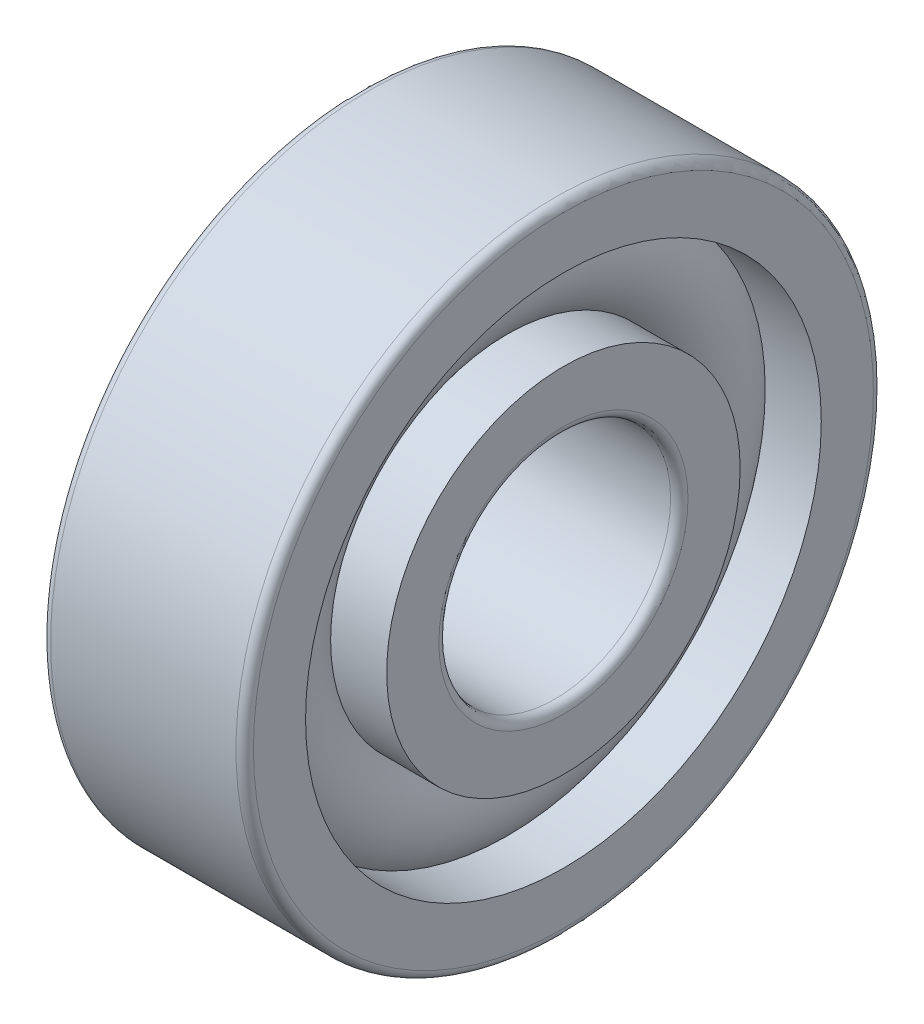
ISO-10303-21;
HEADER;
FILE_DESCRIPTION(('STEP AP214'),'2;1');
FILE_NAME('part.step','',(''),(''),'','','');
FILE_SCHEMA(('AUTOMOTIVE_DESIGN { 1 0 10303 214 1 1 1 1 }'));
ENDSEC;
DATA;
#1=APPLICATION_CONTEXT('core data for automotive mechanical design processes');
#2=APPLICATION_PROTOCOL_DEFINITION('international standard','automotive_design',2000,#1);
#3=PRODUCT_CONTEXT('',#1,'mechanical');
#4=PRODUCT('Part','Part','',(#3));
#5=PRODUCT_RELATED_PRODUCT_CATEGORY('part','',(#4));
#6=PRODUCT_DEFINITION_FORMATION('','',#4);
#7=PRODUCT_DEFINITION_CONTEXT('part definition',#1,'design');
#8=PRODUCT_DEFINITION('design','',#6,#7);
#9=PRODUCT_DEFINITION_SHAPE('','',#8);
#10=(LENGTH_UNIT() NAMED_UNIT(*) SI_UNIT(.MILLI.,.METRE.));
#11=(NAMED_UNIT(*) PLANE_ANGLE_UNIT() SI_UNIT($,.RADIAN.));
#12=(NAMED_UNIT(*) SI_UNIT($,.STERADIAN.) SOLID_ANGLE_UNIT());
#13=UNCERTAINTY_MEASURE_WITH_UNIT(LENGTH_MEASURE(1.E-05),#10,'distance_accuracy_value','');
#14=(GEOMETRIC_REPRESENTATION_CONTEXT(3) GLOBAL_UNCERTAINTY_ASSIGNED_CONTEXT((#13)) GLOBAL_UNIT_ASSIGNED_CONTEXT((#10,
#11,#12)) REPRESENTATION_CONTEXT('',''));
#15=CARTESIAN_POINT('',(0.,0.,0.));
#16=DIRECTION('',(0.,0.,1.));
#17=DIRECTION('',(1.,0.,0.));
#18=AXIS2_PLACEMENT_3D('',#15,#16,#17);
#19=CARTESIAN_POINT('',(0.,0.,0.));
#20=DIRECTION('',(-1.,0.,0.));
#21=DIRECTION('',(0.,0.,1.));
#22=AXIS2_PLACEMENT_3D('',#19,#20,#21);
#23=TOROIDAL_SURFACE('',#22,7.5,2.1);
#24=CARTESIAN_POINT('',(1.56524758424985,0.,0.));
#25=DIRECTION('',(-1.,0.,0.));
#26=DIRECTION('',(0.,0.,1.));
#27=AXIS2_PLACEMENT_3D('',#24,#25,#26);
#28=CIRCLE('',#27,8.9);
#29=CARTESIAN_POINT('',(1.56524758424985,0.,8.9));
#30=VERTEX_POINT('',#29);
#31=EDGE_CURVE('E18',#30,#30,#28,.F.);
#32=ORIENTED_EDGE('',*,*,#31,.T.);
#33=EDGE_LOOP('',(#32));
#34=FACE_BOUND('',#33,.T.);
#35=CARTESIAN_POINT('',(1.56524758424985,0.,0.));
#36=DIRECTION('',(-1.,0.,0.));
#37=DIRECTION('',(0.,0.,1.));
#38=AXIS2_PLACEMENT_3D('',#35,#36,#37);
#39=CIRCLE('',#38,6.1);
#40=CARTESIAN_POINT('',(1.56524758424985,0.,6.1));
#41=VERTEX_POINT('',#40);
#42=EDGE_CURVE('E10',#41,#41,#39,.T.);
#43=ORIENTED_EDGE('',*,*,#42,.T.);
#44=EDGE_LOOP('',(#43));
#45=FACE_BOUND('',#44,.T.);
#46=ADVANCED_FACE('F14',(#34,#45),#23,.T.);
#47=CARTESIAN_POINT('',(-20.6375,0.,0.));
#48=DIRECTION('',(1.,0.,0.));
#49=DIRECTION('',(0.,0.,-1.));
#50=AXIS2_PLACEMENT_3D('',#47,#48,#49);
#51=CYLINDRICAL_SURFACE('',#50,6.1);
#52=CARTESIAN_POINT('',(3.5,0.,0.));
#53=DIRECTION('',(1.,0.,0.));
#54=DIRECTION('',(0.,0.,-1.));
#55=AXIS2_PLACEMENT_3D('',#52,#53,#54);
#56=CIRCLE('',#55,6.1);
#57=CARTESIAN_POINT('',(3.5,0.,-6.1));
#58=VERTEX_POINT('',#57);
#59=EDGE_CURVE('E27',#58,#58,#56,.T.);
#60=ORIENTED_EDGE('',*,*,#59,.F.);
#61=EDGE_LOOP('',(#60));
#62=FACE_BOUND('',#61,.T.);
#63=ORIENTED_EDGE('',*,*,#42,.F.);
#64=EDGE_LOOP('',(#63));
#65=FACE_BOUND('',#64,.T.);
#66=ADVANCED_FACE('F66',(#62,#65),#51,.T.);
#67=CARTESIAN_POINT('',(-20.6375,0.,0.));
#68=DIRECTION('',(1.,0.,0.));
#69=DIRECTION('',(0.,0.,-1.));
#70=AXIS2_PLACEMENT_3D('',#67,#68,#69);
#71=CYLINDRICAL_SURFACE('',#70,6.1);
#72=CARTESIAN_POINT('',(-3.5,0.,0.));
#73=DIRECTION('',(1.,0.,0.));
#74=DIRECTION('',(0.,0.,-1.));
#75=AXIS2_PLACEMENT_3D('',#72,#73,#74);
#76=CIRCLE('',#75,6.1);
#77=CARTESIAN_POINT('',(-3.5,0.,-6.1));
#78=VERTEX_POINT('',#77);
#79=EDGE_CURVE('E36',#78,#78,#76,.T.);
#80=ORIENTED_EDGE('',*,*,#79,.T.);
#81=EDGE_LOOP('',(#80));
#82=FACE_BOUND('',#81,.T.);
#83=CARTESIAN_POINT('',(-1.56524758424985,0.,0.));
#84=DIRECTION('',(1.,0.,0.));
#85=DIRECTION('',(0.,0.,-1.));
#86=AXIS2_PLACEMENT_3D('',#83,#84,#85);
#87=CIRCLE('',#86,6.1);
#88=CARTESIAN_POINT('',(-1.56524758424985,0.,-6.1));
#89=VERTEX_POINT('',#88);
#90=EDGE_CURVE('E22',#89,#89,#87,.T.);
#91=ORIENTED_EDGE('',*,*,#90,.F.);
#92=EDGE_LOOP('',(#91));
#93=FACE_BOUND('',#92,.T.);
#94=ADVANCED_FACE('F69',(#82,#93),#71,.T.);
#95=CARTESIAN_POINT('',(3.5,4.3,0.));
#96=DIRECTION('',(1.,0.,0.));
#97=DIRECTION('',(0.,0.,-1.));
#98=AXIS2_PLACEMENT_3D('',#95,#96,#97);
#99=PLANE('',#98);
#100=ORIENTED_EDGE('',*,*,#59,.T.);
#101=EDGE_LOOP('',(#100));
#102=FACE_BOUND('',#101,.T.);
#103=CARTESIAN_POINT('',(3.5,0.,0.));
#104=DIRECTION('',(1.,0.,0.));
#105=DIRECTION('',(0.,0.,-1.));
#106=AXIS2_PLACEMENT_3D('',#103,#104,#105);
#107=CIRCLE('',#106,4.3);
#108=CARTESIAN_POINT('',(3.5,0.,-4.3));
#109=VERTEX_POINT('',#108);
#110=EDGE_CURVE('E58',#109,#109,#107,.T.);
#111=ORIENTED_EDGE('',*,*,#110,.F.);
#112=EDGE_LOOP('',(#111));
#113=FACE_BOUND('',#112,.T.);
#114=ADVANCED_FACE('F63',(#102,#113),#99,.T.);
#115=CARTESIAN_POINT('',(3.2,0.,0.));
#116=DIRECTION('',(1.,0.,0.));
#117=DIRECTION('',(0.,0.,-1.));
#118=AXIS2_PLACEMENT_3D('',#115,#116,#117);
#119=TOROIDAL_SURFACE('',#118,4.3,0.3);
#120=ORIENTED_EDGE('',*,*,#110,.T.);
#121=EDGE_LOOP('',(#120));
#122=FACE_BOUND('',#121,.T.);
#123=CARTESIAN_POINT('',(3.2,0.,0.));
#124=DIRECTION('',(1.,0.,0.));
#125=DIRECTION('',(0.,0.,-1.));
#126=AXIS2_PLACEMENT_3D('',#123,#124,#125);
#127=CIRCLE('',#126,4.);
#128=CARTESIAN_POINT('',(3.2,0.,-4.));
#129=VERTEX_POINT('',#128);
#130=EDGE_CURVE('E55',#129,#129,#127,.T.);
#131=ORIENTED_EDGE('',*,*,#130,.F.);
#132=EDGE_LOOP('',(#131));
#133=FACE_BOUND('',#132,.T.);
#134=ADVANCED_FACE('F82',(#122,#133),#119,.T.);
#135=CARTESIAN_POINT('',(-20.6375,0.,0.));
#136=DIRECTION('',(1.,0.,0.));
#137=DIRECTION('',(0.,0.,-1.));
#138=AXIS2_PLACEMENT_3D('',#135,#136,#137);
#139=CYLINDRICAL_SURFACE('',#138,4.);
#140=ORIENTED_EDGE('',*,*,#130,.T.);
#141=EDGE_LOOP('',(#140));
#142=FACE_BOUND('',#141,.T.);
#143=CARTESIAN_POINT('',(-3.2,0.,0.));
#144=DIRECTION('',(1.,0.,0.));
#145=DIRECTION('',(0.,0.,-1.));
#146=AXIS2_PLACEMENT_3D('',#143,#144,#145);
#147=CIRCLE('',#146,4.);
#148=CARTESIAN_POINT('',(-3.2,0.,-4.));
#149=VERTEX_POINT('',#148);
#150=EDGE_CURVE('E52',#149,#149,#147,.T.);
#151=ORIENTED_EDGE('',*,*,#150,.F.);
#152=EDGE_LOOP('',(#151));
#153=FACE_BOUND('',#152,.T.);
#154=ADVANCED_FACE('F85',(#142,#153),#139,.F.);
#155=CARTESIAN_POINT('',(-3.2,0.,0.));
#156=DIRECTION('',(1.,0.,0.));
#157=DIRECTION('',(0.,0.,-1.));
#158=AXIS2_PLACEMENT_3D('',#155,#156,#157);
#159=TOROIDAL_SURFACE('',#158,4.3,0.3);
#160=ORIENTED_EDGE('',*,*,#150,.T.);
#161=EDGE_LOOP('',(#160));
#162=FACE_BOUND('',#161,.T.);
#163=CARTESIAN_POINT('',(-3.5,0.,0.));
#164=DIRECTION('',(1.,0.,0.));
#165=DIRECTION('',(0.,0.,-1.));
#166=AXIS2_PLACEMENT_3D('',#163,#164,#165);
#167=CIRCLE('',#166,4.3);
#168=CARTESIAN_POINT('',(-3.5,0.,-4.3));
#169=VERTEX_POINT('',#168);
#170=EDGE_CURVE('E49',#169,#169,#167,.T.);
#171=ORIENTED_EDGE('',*,*,#170,.F.);
#172=EDGE_LOOP('',(#171));
#173=FACE_BOUND('',#172,.T.);
#174=ADVANCED_FACE('F89',(#162,#173),#159,.T.);
#175=CARTESIAN_POINT('',(-3.5,6.1,0.));
#176=DIRECTION('',(-1.,0.,0.));
#177=DIRECTION('',(0.,0.,1.));
#178=AXIS2_PLACEMENT_3D('',#175,#176,#177);
#179=PLANE('',#178);
#180=ORIENTED_EDGE('',*,*,#170,.T.);
#181=EDGE_LOOP('',(#180));
#182=FACE_BOUND('',#181,.T.);
#183=ORIENTED_EDGE('',*,*,#79,.F.);
#184=EDGE_LOOP('',(#183));
#185=FACE_BOUND('',#184,.T.);
#186=ADVANCED_FACE('F93',(#182,#185),#179,.T.);
#187=CARTESIAN_POINT('',(-1.56524758424985,0.,0.));
#188=DIRECTION('',(1.,0.,0.));
#189=DIRECTION('',(0.,0.,-1.));
#190=AXIS2_PLACEMENT_3D('',#187,#188,#189);
#191=CIRCLE('',#190,8.9);
#192=CARTESIAN_POINT('',(-1.56524758424985,0.,-8.9));
#193=VERTEX_POINT('',#192);
#194=EDGE_CURVE('E30',#193,#193,#191,.F.);
#195=ORIENTED_EDGE('',*,*,#194,.T.);
#196=EDGE_LOOP('',(#195));
#197=FACE_BOUND('',#196,.T.);
#198=ORIENTED_EDGE('',*,*,#90,.T.);
#199=EDGE_LOOP('',(#198));
#200=FACE_BOUND('',#199,.T.);
#201=ADVANCED_FACE('F16',(#197,#200),#23,.T.);
#202=CARTESIAN_POINT('',(-20.6375,0.,0.));
#203=DIRECTION('',(1.,0.,0.));
#204=DIRECTION('',(0.,0.,-1.));
#205=AXIS2_PLACEMENT_3D('',#202,#203,#204);
#206=CYLINDRICAL_SURFACE('',#205,8.9);
#207=CARTESIAN_POINT('',(3.5,0.,0.));
#208=DIRECTION('',(1.,0.,0.));
#209=DIRECTION('',(0.,0.,-1.));
#210=AXIS2_PLACEMENT_3D('',#207,#208,#209);
#211=CIRCLE('',#210,8.9);
#212=CARTESIAN_POINT('',(3.5,0.,-8.9));
#213=VERTEX_POINT('',#212);
#214=EDGE_CURVE('E32',#213,#213,#211,.T.);
#215=ORIENTED_EDGE('',*,*,#214,.T.);
#216=EDGE_LOOP('',(#215));
#217=FACE_BOUND('',#216,.T.);
#218=ORIENTED_EDGE('',*,*,#31,.F.);
#219=EDGE_LOOP('',(#218));
#220=FACE_BOUND('',#219,.T.);
#221=ADVANCED_FACE('F98',(#217,#220),#206,.F.);
#222=CARTESIAN_POINT('',(-20.6375,0.,0.));
#223=DIRECTION('',(1.,0.,0.));
#224=DIRECTION('',(0.,0.,-1.));
#225=AXIS2_PLACEMENT_3D('',#222,#223,#224);
#226=CYLINDRICAL_SURFACE('',#225,8.9);
#227=CARTESIAN_POINT('',(-3.5,0.,0.));
#228=DIRECTION('',(1.,0.,0.));
#229=DIRECTION('',(0.,0.,-1.));
#230=AXIS2_PLACEMENT_3D('',#227,#228,#229);
#231=CIRCLE('',#230,8.9);
#232=CARTESIAN_POINT('',(-3.5,0.,-8.9));
#233=VERTEX_POINT('',#232);
#234=EDGE_CURVE('E130',#233,#233,#231,.T.);
#235=ORIENTED_EDGE('',*,*,#234,.F.);
#236=EDGE_LOOP('',(#235));
#237=FACE_BOUND('',#236,.T.);
#238=ORIENTED_EDGE('',*,*,#194,.F.);
#239=EDGE_LOOP('',(#238));
#240=FACE_BOUND('',#239,.T.);
#241=ADVANCED_FACE('F101',(#237,#240),#226,.F.);
#242=CARTESIAN_POINT('',(3.5,10.7,0.));
#243=DIRECTION('',(1.,0.,0.));
#244=DIRECTION('',(0.,0.,-1.));
#245=AXIS2_PLACEMENT_3D('',#242,#243,#244);
#246=PLANE('',#245);
#247=CARTESIAN_POINT('',(3.5,0.,0.));
#248=DIRECTION('',(1.,0.,0.));
#249=DIRECTION('',(0.,0.,-1.));
#250=AXIS2_PLACEMENT_3D('',#247,#248,#249);
#251=CIRCLE('',#250,10.7);
#252=CARTESIAN_POINT('',(3.5,0.,-10.7));
#253=VERTEX_POINT('',#252);
#254=EDGE_CURVE('E38',#253,#253,#251,.T.);
#255=ORIENTED_EDGE('',*,*,#254,.T.);
#256=EDGE_LOOP('',(#255));
#257=FACE_BOUND('',#256,.T.);
#258=ORIENTED_EDGE('',*,*,#214,.F.);
#259=EDGE_LOOP('',(#258));
#260=FACE_BOUND('',#259,.T.);
#261=ADVANCED_FACE('F102',(#257,#260),#246,.T.);
#262=CARTESIAN_POINT('',(3.2,0.,0.));
#263=DIRECTION('',(1.,0.,0.));
#264=DIRECTION('',(0.,0.,-1.));
#265=AXIS2_PLACEMENT_3D('',#262,#263,#264);
#266=TOROIDAL_SURFACE('',#265,10.7,0.3);
#267=CARTESIAN_POINT('',(3.2,0.,0.));
#268=DIRECTION('',(1.,0.,0.));
#269=DIRECTION('',(0.,0.,-1.));
#270=AXIS2_PLACEMENT_3D('',#267,#268,#269);
#271=CIRCLE('',#270,11.);
#272=CARTESIAN_POINT('',(3.2,0.,-11.));
#273=VERTEX_POINT('',#272);
#274=EDGE_CURVE('E43',#273,#273,#271,.T.);
#275=ORIENTED_EDGE('',*,*,#274,.T.);
#276=EDGE_LOOP('',(#275));
#277=FACE_BOUND('',#276,.T.);
#278=ORIENTED_EDGE('',*,*,#254,.F.);
#279=EDGE_LOOP('',(#278));
#280=FACE_BOUND('',#279,.T.);
#281=ADVANCED_FACE('F105',(#277,#280),#266,.T.);
#282=CARTESIAN_POINT('',(-20.6375,0.,0.));
#283=DIRECTION('',(1.,0.,0.));
#284=DIRECTION('',(0.,0.,-1.));
#285=AXIS2_PLACEMENT_3D('',#282,#283,#284);
#286=CYLINDRICAL_SURFACE('',#285,11.);
#287=CARTESIAN_POINT('',(-3.2,0.,0.));
#288=DIRECTION('',(1.,0.,0.));
#289=DIRECTION('',(0.,0.,-1.));
#290=AXIS2_PLACEMENT_3D('',#287,#288,#289);
#291=CIRCLE('',#290,11.);
#292=CARTESIAN_POINT('',(-3.2,0.,-11.));
#293=VERTEX_POINT('',#292);
#294=EDGE_CURVE('E134',#293,#293,#291,.T.);
#295=ORIENTED_EDGE('',*,*,#294,.T.);
#296=EDGE_LOOP('',(#295));
#297=FACE_BOUND('',#296,.T.);
#298=ORIENTED_EDGE('',*,*,#274,.F.);
#299=EDGE_LOOP('',(#298));
#300=FACE_BOUND('',#299,.T.);
#301=ADVANCED_FACE('F109',(#297,#300),#286,.T.);
#302=CARTESIAN_POINT('',(-3.2,0.,0.));
#303=DIRECTION('',(1.,0.,0.));
#304=DIRECTION('',(0.,0.,-1.));
#305=AXIS2_PLACEMENT_3D('',#302,#303,#304);
#306=TOROIDAL_SURFACE('',#305,10.7,0.3);
#307=CARTESIAN_POINT('',(-3.5,0.,0.));
#308=DIRECTION('',(1.,0.,0.));
#309=DIRECTION('',(0.,0.,-1.));
#310=AXIS2_PLACEMENT_3D('',#307,#308,#309);
#311=CIRCLE('',#310,10.7);
#312=CARTESIAN_POINT('',(-3.5,0.,-10.7));
#313=VERTEX_POINT('',#312);
#314=EDGE_CURVE('E131',#313,#313,#311,.T.);
#315=ORIENTED_EDGE('',*,*,#314,.T.);
#316=EDGE_LOOP('',(#315));
#317=FACE_BOUND('',#316,.T.);
#318=ORIENTED_EDGE('',*,*,#294,.F.);
#319=EDGE_LOOP('',(#318));
#320=FACE_BOUND('',#319,.T.);
#321=ADVANCED_FACE('F113',(#317,#320),#306,.T.);
#322=CARTESIAN_POINT('',(-3.5,8.9,0.));
#323=DIRECTION('',(-1.,0.,0.));
#324=DIRECTION('',(0.,0.,1.));
#325=AXIS2_PLACEMENT_3D('',#322,#323,#324);
#326=PLANE('',#325);
#327=ORIENTED_EDGE('',*,*,#234,.T.);
#328=EDGE_LOOP('',(#327));
#329=FACE_BOUND('',#328,.T.);
#330=ORIENTED_EDGE('',*,*,#314,.F.);
#331=EDGE_LOOP('',(#330));
#332=FACE_BOUND('',#331,.T.);
#333=ADVANCED_FACE('F117',(#329,#332),#326,.T.);
#334=CLOSED_SHELL('',(#46,#66,#94,#114,#134,#154,#174,#186,#201,#221,#241,#261,#281,#301,#321,#333));
#335=MANIFOLD_SOLID_BREP('B1',#334);
#336=ADVANCED_BREP_SHAPE_REPRESENTATION('',(#18,#335),#14);
#337=SHAPE_DEFINITION_REPRESENTATION(#9,#336);
ENDSEC;
END-ISO-10303-21;
